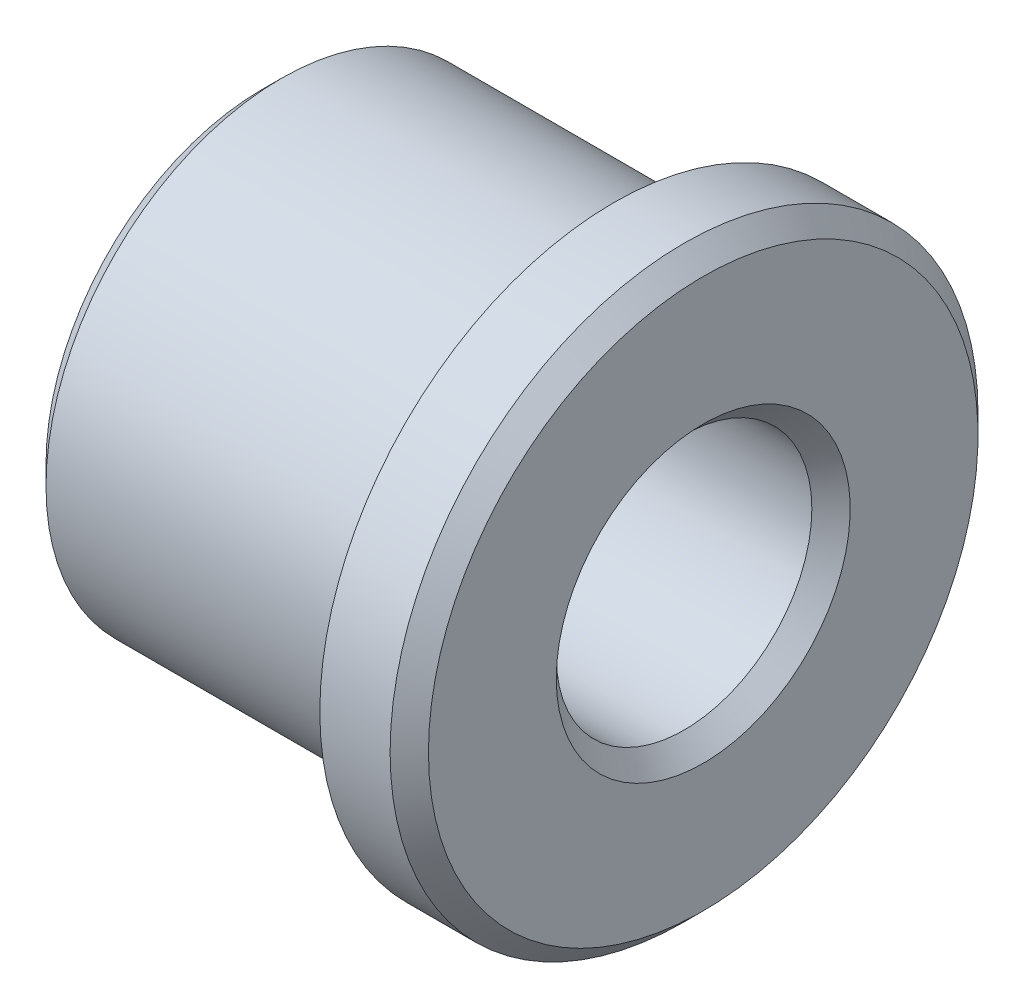
ISO-10303-21;
HEADER;
FILE_DESCRIPTION(('STEP AP214'),'2;1');
FILE_NAME('part.step','',(''),(''),'','','');
FILE_SCHEMA(('AUTOMOTIVE_DESIGN { 1 0 10303 214 1 1 1 1 }'));
ENDSEC;
DATA;
#1=APPLICATION_CONTEXT('core data for automotive mechanical design processes');
#2=APPLICATION_PROTOCOL_DEFINITION('international standard','automotive_design',2000,#1);
#3=PRODUCT_CONTEXT('',#1,'mechanical');
#4=PRODUCT('Part','Part','',(#3));
#5=PRODUCT_RELATED_PRODUCT_CATEGORY('part','',(#4));
#6=PRODUCT_DEFINITION_FORMATION('','',#4);
#7=PRODUCT_DEFINITION_CONTEXT('part definition',#1,'design');
#8=PRODUCT_DEFINITION('design','',#6,#7);
#9=PRODUCT_DEFINITION_SHAPE('','',#8);
#10=(LENGTH_UNIT() NAMED_UNIT(*) SI_UNIT(.MILLI.,.METRE.));
#11=(NAMED_UNIT(*) PLANE_ANGLE_UNIT() SI_UNIT($,.RADIAN.));
#12=(NAMED_UNIT(*) SI_UNIT($,.STERADIAN.) SOLID_ANGLE_UNIT());
#13=UNCERTAINTY_MEASURE_WITH_UNIT(LENGTH_MEASURE(1.E-05),#10,'distance_accuracy_value','');
#14=(GEOMETRIC_REPRESENTATION_CONTEXT(3) GLOBAL_UNCERTAINTY_ASSIGNED_CONTEXT((#13)) GLOBAL_UNIT_ASSIGNED_CONTEXT((#10,
#11,#12)) REPRESENTATION_CONTEXT('',''));
#15=CARTESIAN_POINT('',(0.,0.,0.));
#16=DIRECTION('',(0.,0.,1.));
#17=DIRECTION('',(1.,0.,0.));
#18=AXIS2_PLACEMENT_3D('',#15,#16,#17);
#19=CARTESIAN_POINT('',(-4.44433578800046,0.,0.));
#20=DIRECTION('',(-1.,0.,0.));
#21=DIRECTION('',(0.,0.,1.));
#22=AXIS2_PLACEMENT_3D('',#19,#20,#21);
#23=CYLINDRICAL_SURFACE('',#22,18.425);
#24=CARTESIAN_POINT('',(1.49999999999999,0.,0.));
#25=DIRECTION('',(1.,0.,0.));
#26=DIRECTION('',(0.,0.,-1.));
#27=AXIS2_PLACEMENT_3D('',#24,#25,#26);
#28=CIRCLE('',#27,18.425);
#29=CARTESIAN_POINT('',(1.49999999999999,0.,-18.425));
#30=VERTEX_POINT('',#29);
#31=EDGE_CURVE('E10',#30,#30,#28,.T.);
#32=ORIENTED_EDGE('',*,*,#31,.T.);
#33=EDGE_LOOP('',(#32));
#34=FACE_BOUND('',#33,.T.);
#35=CARTESIAN_POINT('',(27.5,0.,0.));
#36=DIRECTION('',(-1.,0.,0.));
#37=DIRECTION('',(0.,0.,1.));
#38=AXIS2_PLACEMENT_3D('',#35,#36,#37);
#39=CIRCLE('',#38,18.425);
#40=CARTESIAN_POINT('',(27.5,0.,18.425));
#41=VERTEX_POINT('',#40);
#42=EDGE_CURVE('E64',#41,#41,#39,.T.);
#43=ORIENTED_EDGE('',*,*,#42,.T.);
#44=EDGE_LOOP('',(#43));
#45=FACE_BOUND('',#44,.T.);
#46=ADVANCED_FACE('F32',(#34,#45),#23,.T.);
#47=CARTESIAN_POINT('',(27.5,23.,0.));
#48=DIRECTION('',(1.,0.,0.));
#49=DIRECTION('',(0.,0.,-1.));
#50=AXIS2_PLACEMENT_3D('',#47,#48,#49);
#51=PLANE('',#50);
#52=ORIENTED_EDGE('',*,*,#42,.F.);
#53=EDGE_LOOP('',(#52));
#54=FACE_BOUND('',#53,.T.);
#55=CARTESIAN_POINT('',(27.5,0.,0.));
#56=DIRECTION('',(-1.,0.,0.));
#57=DIRECTION('',(0.,0.,1.));
#58=AXIS2_PLACEMENT_3D('',#55,#56,#57);
#59=CIRCLE('',#58,23.);
#60=CARTESIAN_POINT('',(27.5,0.,23.));
#61=VERTEX_POINT('',#60);
#62=EDGE_CURVE('E67',#61,#61,#59,.T.);
#63=ORIENTED_EDGE('',*,*,#62,.T.);
#64=EDGE_LOOP('',(#63));
#65=FACE_BOUND('',#64,.T.);
#66=ADVANCED_FACE('F71',(#54,#65),#51,.F.);
#67=CARTESIAN_POINT('',(-4.44433578800046,0.,0.));
#68=DIRECTION('',(-1.,0.,0.));
#69=DIRECTION('',(0.,0.,1.));
#70=AXIS2_PLACEMENT_3D('',#67,#68,#69);
#71=CYLINDRICAL_SURFACE('',#70,23.);
#72=CARTESIAN_POINT('',(33.,0.,0.));
#73=DIRECTION('',(-1.,0.,0.));
#74=DIRECTION('',(0.,0.,1.));
#75=AXIS2_PLACEMENT_3D('',#72,#73,#74);
#76=CIRCLE('',#75,23.);
#77=CARTESIAN_POINT('',(33.,0.,23.));
#78=VERTEX_POINT('',#77);
#79=EDGE_CURVE('E47',#78,#78,#76,.T.);
#80=ORIENTED_EDGE('',*,*,#79,.T.);
#81=EDGE_LOOP('',(#80));
#82=FACE_BOUND('',#81,.T.);
#83=ORIENTED_EDGE('',*,*,#62,.F.);
#84=EDGE_LOOP('',(#83));
#85=FACE_BOUND('',#84,.T.);
#86=ADVANCED_FACE('F73',(#82,#85),#71,.T.);
#87=CARTESIAN_POINT('',(34.5,10.,0.));
#88=DIRECTION('',(-1.,0.,0.));
#89=DIRECTION('',(0.,0.,1.));
#90=AXIS2_PLACEMENT_3D('',#87,#88,#89);
#91=PLANE('',#90);
#92=CARTESIAN_POINT('',(34.5,0.,0.));
#93=DIRECTION('',(-1.,0.,0.));
#94=DIRECTION('',(0.,0.,1.));
#95=AXIS2_PLACEMENT_3D('',#92,#93,#94);
#96=CIRCLE('',#95,11.5);
#97=CARTESIAN_POINT('',(34.5,0.,11.5));
#98=VERTEX_POINT('',#97);
#99=EDGE_CURVE('E58',#98,#98,#96,.T.);
#100=ORIENTED_EDGE('',*,*,#99,.T.);
#101=EDGE_LOOP('',(#100));
#102=FACE_BOUND('',#101,.T.);
#103=CARTESIAN_POINT('',(34.5,0.,0.));
#104=DIRECTION('',(-1.,0.,0.));
#105=DIRECTION('',(0.,0.,1.));
#106=AXIS2_PLACEMENT_3D('',#103,#104,#105);
#107=CIRCLE('',#106,21.5);
#108=CARTESIAN_POINT('',(34.5,0.,21.5));
#109=VERTEX_POINT('',#108);
#110=EDGE_CURVE('E61',#109,#109,#107,.F.);
#111=ORIENTED_EDGE('',*,*,#110,.T.);
#112=EDGE_LOOP('',(#111));
#113=FACE_BOUND('',#112,.T.);
#114=ADVANCED_FACE('F75',(#102,#113),#91,.F.);
#115=CARTESIAN_POINT('',(-4.44433578800046,0.,0.));
#116=DIRECTION('',(-1.,0.,0.));
#117=DIRECTION('',(0.,0.,1.));
#118=AXIS2_PLACEMENT_3D('',#115,#116,#117);
#119=CYLINDRICAL_SURFACE('',#118,10.);
#120=CARTESIAN_POINT('',(33.,0.,0.));
#121=DIRECTION('',(-1.,0.,0.));
#122=DIRECTION('',(0.,0.,1.));
#123=AXIS2_PLACEMENT_3D('',#120,#121,#122);
#124=CIRCLE('',#123,10.);
#125=CARTESIAN_POINT('',(33.,0.,10.));
#126=VERTEX_POINT('',#125);
#127=EDGE_CURVE('E52',#126,#126,#124,.F.);
#128=ORIENTED_EDGE('',*,*,#127,.T.);
#129=EDGE_LOOP('',(#128));
#130=FACE_BOUND('',#129,.T.);
#131=CARTESIAN_POINT('',(1.49999999999999,0.,0.));
#132=DIRECTION('',(1.,0.,0.));
#133=DIRECTION('',(0.,0.,-1.));
#134=AXIS2_PLACEMENT_3D('',#131,#132,#133);
#135=CIRCLE('',#134,10.);
#136=CARTESIAN_POINT('',(1.49999999999999,0.,-10.));
#137=VERTEX_POINT('',#136);
#138=EDGE_CURVE('E55',#137,#137,#135,.F.);
#139=ORIENTED_EDGE('',*,*,#138,.T.);
#140=EDGE_LOOP('',(#139));
#141=FACE_BOUND('',#140,.T.);
#142=ADVANCED_FACE('F82',(#130,#141),#119,.F.);
#143=CARTESIAN_POINT('',(0.,10.,0.));
#144=DIRECTION('',(1.,0.,0.));
#145=DIRECTION('',(0.,0.,-1.));
#146=AXIS2_PLACEMENT_3D('',#143,#144,#145);
#147=PLANE('',#146);
#148=CARTESIAN_POINT('',(0.,0.,0.));
#149=DIRECTION('',(1.,0.,0.));
#150=DIRECTION('',(0.,0.,-1.));
#151=AXIS2_PLACEMENT_3D('',#148,#149,#150);
#152=CIRCLE('',#151,11.5);
#153=CARTESIAN_POINT('',(0.,0.,-11.5));
#154=VERTEX_POINT('',#153);
#155=EDGE_CURVE('E39',#154,#154,#152,.T.);
#156=ORIENTED_EDGE('',*,*,#155,.T.);
#157=EDGE_LOOP('',(#156));
#158=FACE_BOUND('',#157,.T.);
#159=CARTESIAN_POINT('',(0.,0.,0.));
#160=DIRECTION('',(1.,0.,0.));
#161=DIRECTION('',(0.,0.,-1.));
#162=AXIS2_PLACEMENT_3D('',#159,#160,#161);
#163=CIRCLE('',#162,16.925);
#164=CARTESIAN_POINT('',(0.,0.,-16.925));
#165=VERTEX_POINT('',#164);
#166=EDGE_CURVE('E43',#165,#165,#163,.F.);
#167=ORIENTED_EDGE('',*,*,#166,.T.);
#168=EDGE_LOOP('',(#167));
#169=FACE_BOUND('',#168,.T.);
#170=ADVANCED_FACE('F97',(#158,#169),#147,.F.);
#171=CARTESIAN_POINT('',(34.5,0.,0.));
#172=DIRECTION('',(1.,0.,0.));
#173=DIRECTION('',(0.,0.,-1.));
#174=AXIS2_PLACEMENT_3D('',#171,#172,#173);
#175=CONICAL_SURFACE('',#174,11.5,0.785398163397444);
#176=ORIENTED_EDGE('',*,*,#127,.F.);
#177=EDGE_LOOP('',(#176));
#178=FACE_BOUND('',#177,.T.);
#179=ORIENTED_EDGE('',*,*,#99,.F.);
#180=EDGE_LOOP('',(#179));
#181=FACE_BOUND('',#180,.T.);
#182=ADVANCED_FACE('F93',(#178,#181),#175,.F.);
#183=CARTESIAN_POINT('',(33.,0.,0.));
#184=DIRECTION('',(-1.,0.,0.));
#185=DIRECTION('',(0.,0.,1.));
#186=AXIS2_PLACEMENT_3D('',#183,#184,#185);
#187=CONICAL_SURFACE('',#186,23.,0.785398163397453);
#188=ORIENTED_EDGE('',*,*,#110,.F.);
#189=EDGE_LOOP('',(#188));
#190=FACE_BOUND('',#189,.T.);
#191=ORIENTED_EDGE('',*,*,#79,.F.);
#192=EDGE_LOOP('',(#191));
#193=FACE_BOUND('',#192,.T.);
#194=ADVANCED_FACE('F96',(#190,#193),#187,.T.);
#195=CARTESIAN_POINT('',(1.49999999999999,0.,0.));
#196=DIRECTION('',(-1.,0.,0.));
#197=DIRECTION('',(0.,0.,1.));
#198=AXIS2_PLACEMENT_3D('',#195,#196,#197);
#199=CONICAL_SURFACE('',#198,10.,0.785398163397453);
#200=ORIENTED_EDGE('',*,*,#155,.F.);
#201=EDGE_LOOP('',(#200));
#202=FACE_BOUND('',#201,.T.);
#203=ORIENTED_EDGE('',*,*,#138,.F.);
#204=EDGE_LOOP('',(#203));
#205=FACE_BOUND('',#204,.T.);
#206=ADVANCED_FACE('F100',(#202,#205),#199,.F.);
#207=CARTESIAN_POINT('',(0.,0.,0.));
#208=DIRECTION('',(1.,0.,0.));
#209=DIRECTION('',(0.,0.,-1.));
#210=AXIS2_PLACEMENT_3D('',#207,#208,#209);
#211=CONICAL_SURFACE('',#210,16.925,0.785398163397448);
#212=ORIENTED_EDGE('',*,*,#31,.F.);
#213=EDGE_LOOP('',(#212));
#214=FACE_BOUND('',#213,.T.);
#215=ORIENTED_EDGE('',*,*,#166,.F.);
#216=EDGE_LOOP('',(#215));
#217=FACE_BOUND('',#216,.T.);
#218=ADVANCED_FACE('F34',(#214,#217),#211,.T.);
#219=CLOSED_SHELL('',(#46,#66,#86,#114,#142,#170,#182,#194,#206,#218));
#220=MANIFOLD_SOLID_BREP('B2',#219);
#221=ADVANCED_BREP_SHAPE_REPRESENTATION('',(#18,#220),#14);
#222=SHAPE_DEFINITION_REPRESENTATION(#9,#221);
ENDSEC;
END-ISO-10303-21;
